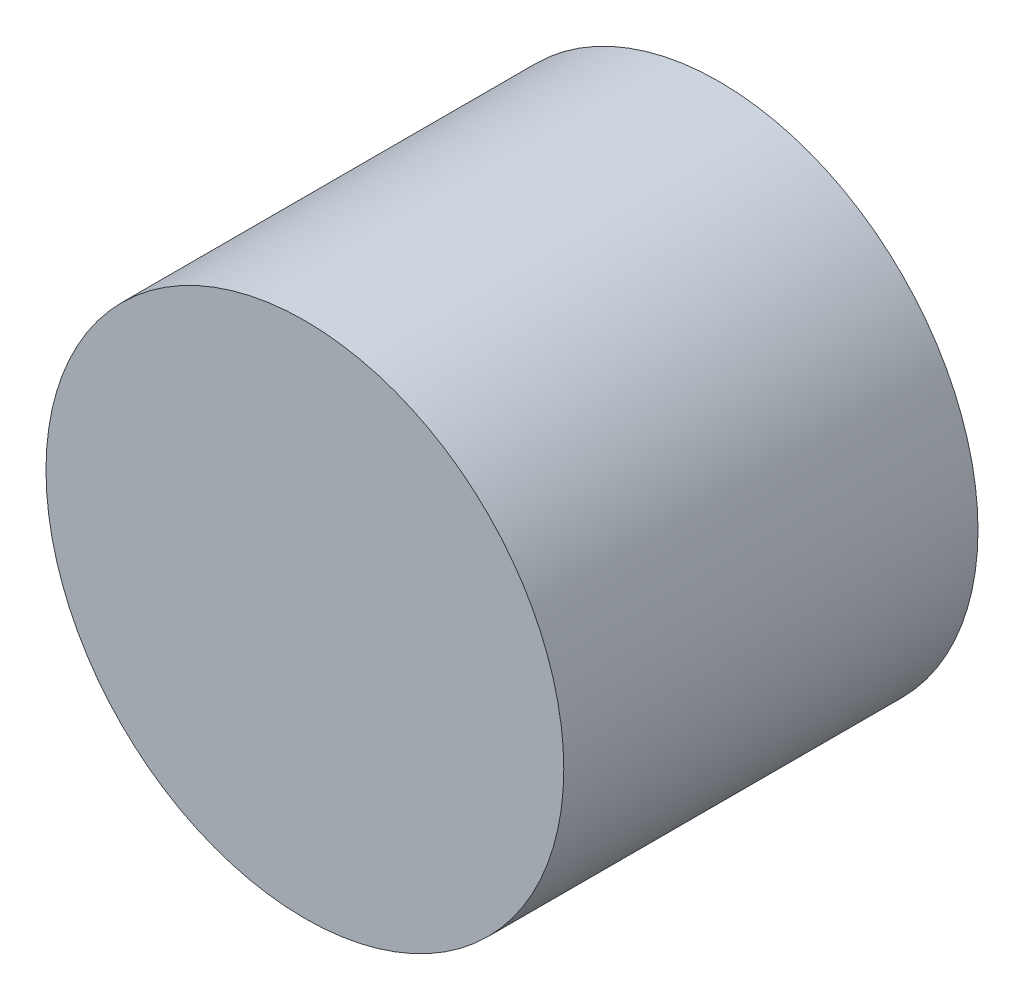
ISO-10303-21;
HEADER;
FILE_DESCRIPTION(('STEP AP214'),'2;1');
FILE_NAME('part.step','',(''),(''),'','','');
FILE_SCHEMA(('AUTOMOTIVE_DESIGN { 1 0 10303 214 1 1 1 1 }'));
ENDSEC;
DATA;
#1=APPLICATION_CONTEXT('core data for automotive mechanical design processes');
#2=APPLICATION_PROTOCOL_DEFINITION('international standard','automotive_design',2000,#1);
#3=PRODUCT_CONTEXT('',#1,'mechanical');
#4=PRODUCT('Part','Part','',(#3));
#5=PRODUCT_RELATED_PRODUCT_CATEGORY('part','',(#4));
#6=PRODUCT_DEFINITION_FORMATION('','',#4);
#7=PRODUCT_DEFINITION_CONTEXT('part definition',#1,'design');
#8=PRODUCT_DEFINITION('design','',#6,#7);
#9=PRODUCT_DEFINITION_SHAPE('','',#8);
#10=(LENGTH_UNIT() NAMED_UNIT(*) SI_UNIT(.MILLI.,.METRE.));
#11=(NAMED_UNIT(*) PLANE_ANGLE_UNIT() SI_UNIT($,.RADIAN.));
#12=(NAMED_UNIT(*) SI_UNIT($,.STERADIAN.) SOLID_ANGLE_UNIT());
#13=UNCERTAINTY_MEASURE_WITH_UNIT(LENGTH_MEASURE(1.E-05),#10,'distance_accuracy_value','');
#14=(GEOMETRIC_REPRESENTATION_CONTEXT(3) GLOBAL_UNCERTAINTY_ASSIGNED_CONTEXT((#13)) GLOBAL_UNIT_ASSIGNED_CONTEXT((#10,
#11,#12)) REPRESENTATION_CONTEXT('',''));
#15=CARTESIAN_POINT('',(0.,0.,0.));
#16=DIRECTION('',(0.,0.,1.));
#17=DIRECTION('',(1.,0.,0.));
#18=AXIS2_PLACEMENT_3D('',#15,#16,#17);
#19=CARTESIAN_POINT('',(0.,0.,10.));
#20=DIRECTION('',(0.,0.,-1.));
#21=DIRECTION('',(-1.,0.,0.));
#22=AXIS2_PLACEMENT_3D('',#19,#20,#21);
#23=CYLINDRICAL_SURFACE('',#22,6.25);
#24=CARTESIAN_POINT('',(0.,0.,10.));
#25=DIRECTION('',(0.,0.,1.));
#26=DIRECTION('',(1.,0.,0.));
#27=AXIS2_PLACEMENT_3D('',#24,#25,#26);
#28=CIRCLE('',#27,6.25);
#29=CARTESIAN_POINT('',(6.25,0.,10.));
#30=VERTEX_POINT('',#29);
#31=EDGE_CURVE('E10',#30,#30,#28,.T.);
#32=ORIENTED_EDGE('',*,*,#31,.F.);
#33=EDGE_LOOP('',(#32));
#34=FACE_BOUND('',#33,.T.);
#35=CARTESIAN_POINT('',(0.,0.,0.));
#36=DIRECTION('',(0.,0.,1.));
#37=DIRECTION('',(1.,0.,0.));
#38=AXIS2_PLACEMENT_3D('',#35,#36,#37);
#39=CIRCLE('',#38,6.25);
#40=CARTESIAN_POINT('',(6.25,0.,0.));
#41=VERTEX_POINT('',#40);
#42=EDGE_CURVE('E34',#41,#41,#39,.T.);
#43=ORIENTED_EDGE('',*,*,#42,.T.);
#44=EDGE_LOOP('',(#43));
#45=FACE_BOUND('',#44,.T.);
#46=ADVANCED_FACE('F31',(#34,#45),#23,.T.);
#47=CARTESIAN_POINT('',(0.,0.,10.));
#48=DIRECTION('',(0.,0.,1.));
#49=DIRECTION('',(1.,0.,0.));
#50=AXIS2_PLACEMENT_3D('',#47,#48,#49);
#51=PLANE('',#50);
#52=ORIENTED_EDGE('',*,*,#31,.T.);
#53=EDGE_LOOP('',(#52));
#54=FACE_BOUND('',#53,.T.);
#55=ADVANCED_FACE('F61',(#54),#51,.T.);
#56=CARTESIAN_POINT('',(0.,0.,0.));
#57=DIRECTION('',(0.,0.,1.));
#58=DIRECTION('',(1.,0.,0.));
#59=AXIS2_PLACEMENT_3D('',#56,#57,#58);
#60=PLANE('',#59);
#61=CARTESIAN_POINT('',(0.,0.,0.));
#62=DIRECTION('',(0.,0.,1.));
#63=DIRECTION('',(1.,0.,0.));
#64=AXIS2_PLACEMENT_3D('',#61,#62,#63);
#65=CIRCLE('',#64,5.25);
#66=CARTESIAN_POINT('',(5.25,0.,0.));
#67=VERTEX_POINT('',#66);
#68=EDGE_CURVE('E43',#67,#67,#65,.T.);
#69=ORIENTED_EDGE('',*,*,#68,.T.);
#70=EDGE_LOOP('',(#69));
#71=FACE_BOUND('',#70,.T.);
#72=ORIENTED_EDGE('',*,*,#42,.F.);
#73=EDGE_LOOP('',(#72));
#74=FACE_BOUND('',#73,.T.);
#75=ADVANCED_FACE('F58',(#71,#74),#60,.F.);
#76=CARTESIAN_POINT('',(0.,0.,8.));
#77=DIRECTION('',(0.,0.,-1.));
#78=DIRECTION('',(-1.,0.,0.));
#79=AXIS2_PLACEMENT_3D('',#76,#77,#78);
#80=CYLINDRICAL_SURFACE('',#79,5.25);
#81=CARTESIAN_POINT('',(0.,0.,8.));
#82=DIRECTION('',(0.,0.,1.));
#83=DIRECTION('',(1.,0.,0.));
#84=AXIS2_PLACEMENT_3D('',#81,#82,#83);
#85=CIRCLE('',#84,5.25);
#86=CARTESIAN_POINT('',(5.25,0.,8.));
#87=VERTEX_POINT('',#86);
#88=EDGE_CURVE('E41',#87,#87,#85,.T.);
#89=ORIENTED_EDGE('',*,*,#88,.T.);
#90=EDGE_LOOP('',(#89));
#91=FACE_BOUND('',#90,.T.);
#92=ORIENTED_EDGE('',*,*,#68,.F.);
#93=EDGE_LOOP('',(#92));
#94=FACE_BOUND('',#93,.T.);
#95=ADVANCED_FACE('F49',(#91,#94),#80,.F.);
#96=CARTESIAN_POINT('',(0.,0.,8.));
#97=DIRECTION('',(0.,0.,1.));
#98=DIRECTION('',(1.,0.,0.));
#99=AXIS2_PLACEMENT_3D('',#96,#97,#98);
#100=PLANE('',#99);
#101=ORIENTED_EDGE('',*,*,#88,.F.);
#102=EDGE_LOOP('',(#101));
#103=FACE_BOUND('',#102,.T.);
#104=ADVANCED_FACE('F52',(#103),#100,.F.);
#105=CLOSED_SHELL('',(#46,#55,#75,#95,#104));
#106=MANIFOLD_SOLID_BREP('B2',#105);
#107=ADVANCED_BREP_SHAPE_REPRESENTATION('',(#18,#106),#14);
#108=SHAPE_DEFINITION_REPRESENTATION(#9,#107);
ENDSEC;
END-ISO-10303-21;
